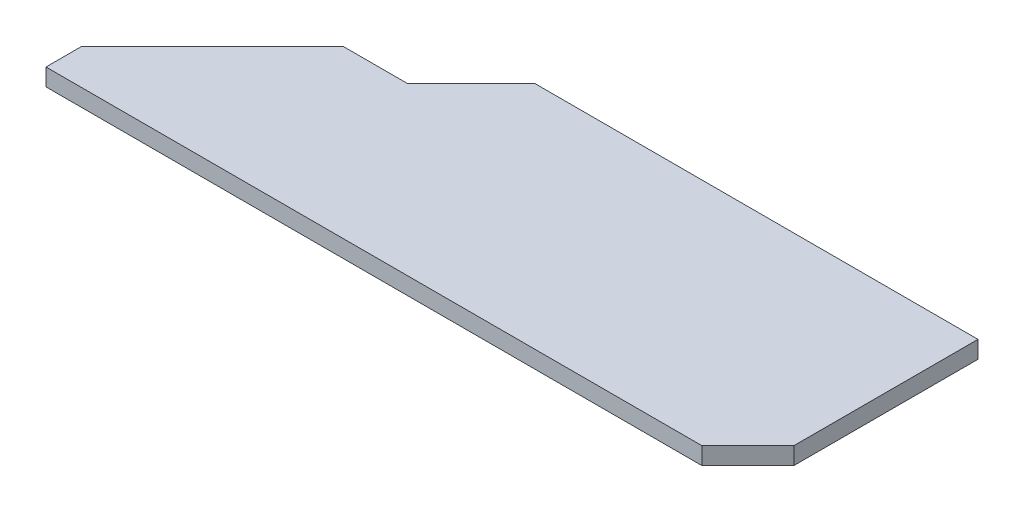
ISO-10303-21;
HEADER;
FILE_DESCRIPTION(('STEP AP214'),'2;1');
FILE_NAME('part.step','',(''),(''),'','','');
FILE_SCHEMA(('AUTOMOTIVE_DESIGN { 1 0 10303 214 1 1 1 1 }'));
ENDSEC;
DATA;
#1=APPLICATION_CONTEXT('core data for automotive mechanical design processes');
#2=APPLICATION_PROTOCOL_DEFINITION('international standard','automotive_design',2000,#1);
#3=PRODUCT_CONTEXT('',#1,'mechanical');
#4=PRODUCT('Part','Part','',(#3));
#5=PRODUCT_RELATED_PRODUCT_CATEGORY('part','',(#4));
#6=PRODUCT_DEFINITION_FORMATION('','',#4);
#7=PRODUCT_DEFINITION_CONTEXT('part definition',#1,'design');
#8=PRODUCT_DEFINITION('design','',#6,#7);
#9=PRODUCT_DEFINITION_SHAPE('','',#8);
#10=(LENGTH_UNIT() NAMED_UNIT(*) SI_UNIT(.MILLI.,.METRE.));
#11=(NAMED_UNIT(*) PLANE_ANGLE_UNIT() SI_UNIT($,.RADIAN.));
#12=(NAMED_UNIT(*) SI_UNIT($,.STERADIAN.) SOLID_ANGLE_UNIT());
#13=UNCERTAINTY_MEASURE_WITH_UNIT(LENGTH_MEASURE(1.E-05),#10,'distance_accuracy_value','');
#14=(GEOMETRIC_REPRESENTATION_CONTEXT(3) GLOBAL_UNCERTAINTY_ASSIGNED_CONTEXT((#13)) GLOBAL_UNIT_ASSIGNED_CONTEXT((#10,
#11,#12)) REPRESENTATION_CONTEXT('',''));
#15=CARTESIAN_POINT('',(0.,0.,0.));
#16=DIRECTION('',(0.,0.,1.));
#17=DIRECTION('',(1.,0.,0.));
#18=AXIS2_PLACEMENT_3D('',#15,#16,#17);
#19=CARTESIAN_POINT('',(-81.4855072463768,3.,-32.7355072463768));
#20=DIRECTION('',(1.,0.,0.));
#21=DIRECTION('',(0.,0.,-1.));
#22=AXIS2_PLACEMENT_3D('',#19,#20,#21);
#23=PLANE('',#22);
#24=DIRECTION('',(0.,0.,1.));
#25=VECTOR('',#24,1.);
#26=CARTESIAN_POINT('',(-81.4855072463768,3.,-32.7355072463768));
#27=LINE('',#26,#25);
#28=CARTESIAN_POINT('',(-81.4855072463769,3.,1.07792425569734));
#29=VERTEX_POINT('',#28);
#30=CARTESIAN_POINT('',(-81.4855072463769,3.,7.26449275362318));
#31=VERTEX_POINT('',#30);
#32=EDGE_CURVE('E159',#29,#31,#27,.T.);
#33=ORIENTED_EDGE('',*,*,#32,.F.);
#34=DIRECTION('',(0.,1.,0.));
#35=VECTOR('',#34,1.);
#36=CARTESIAN_POINT('',(-81.4855072463769,0.,1.07792425569734));
#37=LINE('',#36,#35);
#38=CARTESIAN_POINT('',(-81.4855072463769,0.,1.07792425569734));
#39=VERTEX_POINT('',#38);
#40=EDGE_CURVE('E146',#39,#29,#37,.T.);
#41=ORIENTED_EDGE('',*,*,#40,.F.);
#42=DIRECTION('',(0.,0.,1.));
#43=VECTOR('',#42,1.);
#44=CARTESIAN_POINT('',(-81.4855072463768,0.,-32.7355072463768));
#45=LINE('',#44,#43);
#46=CARTESIAN_POINT('',(-81.4855072463769,0.,7.26449275362318));
#47=VERTEX_POINT('',#46);
#48=EDGE_CURVE('E66',#39,#47,#45,.T.);
#49=ORIENTED_EDGE('',*,*,#48,.T.);
#50=DIRECTION('',(0.,-1.,0.));
#51=VECTOR('',#50,1.);
#52=CARTESIAN_POINT('',(-81.4855072463769,3.,7.26449275362318));
#53=LINE('',#52,#51);
#54=EDGE_CURVE('E11',#31,#47,#53,.T.);
#55=ORIENTED_EDGE('',*,*,#54,.F.);
#56=EDGE_LOOP('',(#33,#41,#49,#55));
#57=FACE_BOUND('',#56,.T.);
#58=ADVANCED_FACE('F32',(#57),#23,.F.);
#59=CARTESIAN_POINT('',(-81.4855072463769,3.,7.26449275362318));
#60=DIRECTION('',(0.,0.,-1.));
#61=DIRECTION('',(-1.,0.,0.));
#62=AXIS2_PLACEMENT_3D('',#59,#60,#61);
#63=PLANE('',#62);
#64=DIRECTION('',(1.,0.,0.));
#65=VECTOR('',#64,1.);
#66=CARTESIAN_POINT('',(-81.4855072463769,0.,7.26449275362318));
#67=LINE('',#66,#65);
#68=CARTESIAN_POINT('',(32.5144927536232,0.,7.26449275362318));
#69=VERTEX_POINT('',#68);
#70=EDGE_CURVE('E111',#47,#69,#67,.T.);
#71=ORIENTED_EDGE('',*,*,#70,.T.);
#72=DIRECTION('',(0.,-1.,0.));
#73=VECTOR('',#72,1.);
#74=CARTESIAN_POINT('',(32.5144927536232,3.,7.26449275362318));
#75=LINE('',#74,#73);
#76=CARTESIAN_POINT('',(32.5144927536232,3.,7.26449275362318));
#77=VERTEX_POINT('',#76);
#78=EDGE_CURVE('E39',#77,#69,#75,.T.);
#79=ORIENTED_EDGE('',*,*,#78,.F.);
#80=DIRECTION('',(1.,0.,0.));
#81=VECTOR('',#80,1.);
#82=CARTESIAN_POINT('',(-81.4855072463769,3.,7.26449275362318));
#83=LINE('',#82,#81);
#84=EDGE_CURVE('E55',#31,#77,#83,.T.);
#85=ORIENTED_EDGE('',*,*,#84,.F.);
#86=ORIENTED_EDGE('',*,*,#54,.T.);
#87=EDGE_LOOP('',(#71,#79,#85,#86));
#88=FACE_BOUND('',#87,.T.);
#89=ADVANCED_FACE('F113',(#88),#63,.F.);
#90=CARTESIAN_POINT('',(-81.4855072463768,3.,-32.7355072463768));
#91=DIRECTION('',(0.,0.,1.));
#92=DIRECTION('',(1.,0.,0.));
#93=AXIS2_PLACEMENT_3D('',#90,#91,#92);
#94=PLANE('',#93);
#95=DIRECTION('',(-1.,0.,0.));
#96=VECTOR('',#95,1.);
#97=CARTESIAN_POINT('',(-81.4855072463768,0.,-32.7355072463768));
#98=LINE('',#97,#96);
#99=CARTESIAN_POINT('',(40.5144927536232,0.,-32.7355072463768));
#100=VERTEX_POINT('',#99);
#101=CARTESIAN_POINT('',(-36.4855072463768,0.,-32.7355072463768));
#102=VERTEX_POINT('',#101);
#103=EDGE_CURVE('E117',#100,#102,#98,.T.);
#104=ORIENTED_EDGE('',*,*,#103,.T.);
#105=DIRECTION('',(0.,1.,0.));
#106=VECTOR('',#105,1.);
#107=CARTESIAN_POINT('',(-36.4855072463768,0.,-32.7355072463768));
#108=LINE('',#107,#106);
#109=CARTESIAN_POINT('',(-36.4855072463768,3.,-32.7355072463768));
#110=VERTEX_POINT('',#109);
#111=EDGE_CURVE('E75',#102,#110,#108,.T.);
#112=ORIENTED_EDGE('',*,*,#111,.T.);
#113=DIRECTION('',(-1.,0.,0.));
#114=VECTOR('',#113,1.);
#115=CARTESIAN_POINT('',(-81.4855072463768,3.,-32.7355072463768));
#116=LINE('',#115,#114);
#117=CARTESIAN_POINT('',(40.5144927536232,3.,-32.7355072463768));
#118=VERTEX_POINT('',#117);
#119=EDGE_CURVE('E124',#118,#110,#116,.T.);
#120=ORIENTED_EDGE('',*,*,#119,.F.);
#121=DIRECTION('',(0.,1.,0.));
#122=VECTOR('',#121,1.);
#123=CARTESIAN_POINT('',(40.5144927536232,0.,-32.7355072463768));
#124=LINE('',#123,#122);
#125=EDGE_CURVE('E137',#100,#118,#124,.T.);
#126=ORIENTED_EDGE('',*,*,#125,.F.);
#127=EDGE_LOOP('',(#104,#112,#120,#126));
#128=FACE_BOUND('',#127,.T.);
#129=ADVANCED_FACE('F168',(#128),#94,.F.);
#130=CARTESIAN_POINT('',(0.,3.,0.));
#131=DIRECTION('',(0.,1.,0.));
#132=DIRECTION('',(0.,0.,1.));
#133=AXIS2_PLACEMENT_3D('',#130,#131,#132);
#134=PLANE('',#133);
#135=DIRECTION('',(0.707106781186547,0.,-0.707106781186548));
#136=VECTOR('',#135,1.);
#137=CARTESIAN_POINT('',(-36.4855072463768,3.,-32.7355072463768));
#138=LINE('',#137,#136);
#139=CARTESIAN_POINT('',(-47.5608260580518,3.,-21.6601884347018));
#140=VERTEX_POINT('',#139);
#141=EDGE_CURVE('E91',#140,#110,#138,.T.);
#142=ORIENTED_EDGE('',*,*,#141,.F.);
#143=DIRECTION('',(1.,0.,0.));
#144=VECTOR('',#143,1.);
#145=CARTESIAN_POINT('',(-47.5608260580518,3.,-21.6601884347018));
#146=LINE('',#145,#144);
#147=CARTESIAN_POINT('',(-58.7473945559778,3.,-21.6601884347018));
#148=VERTEX_POINT('',#147);
#149=EDGE_CURVE('E149',#148,#140,#146,.T.);
#150=ORIENTED_EDGE('',*,*,#149,.F.);
#151=DIRECTION('',(0.707106781186548,0.,-0.707106781186547));
#152=VECTOR('',#151,1.);
#153=CARTESIAN_POINT('',(-72.5323385050532,3.,-7.87524448562647));
#154=LINE('',#153,#152);
#155=EDGE_CURVE('E140',#29,#148,#154,.T.);
#156=ORIENTED_EDGE('',*,*,#155,.F.);
#157=ORIENTED_EDGE('',*,*,#32,.T.);
#158=ORIENTED_EDGE('',*,*,#84,.T.);
#159=DIRECTION('',(0.707106781186546,0.,-0.707106781186549));
#160=VECTOR('',#159,1.);
#161=CARTESIAN_POINT('',(32.5144927536232,3.,7.26449275362318));
#162=LINE('',#161,#160);
#163=CARTESIAN_POINT('',(40.5144927536232,3.,-0.735507246376851));
#164=VERTEX_POINT('',#163);
#165=EDGE_CURVE('E123',#77,#164,#162,.T.);
#166=ORIENTED_EDGE('',*,*,#165,.T.);
#167=DIRECTION('',(0.,0.,-1.));
#168=VECTOR('',#167,1.);
#169=CARTESIAN_POINT('',(40.5144927536232,3.,-0.735507246376851));
#170=LINE('',#169,#168);
#171=EDGE_CURVE('E129',#164,#118,#170,.T.);
#172=ORIENTED_EDGE('',*,*,#171,.T.);
#173=ORIENTED_EDGE('',*,*,#119,.T.);
#174=EDGE_LOOP('',(#142,#150,#156,#157,#158,#166,#172,#173));
#175=FACE_BOUND('',#174,.T.);
#176=ADVANCED_FACE('F173',(#175),#134,.T.);
#177=CARTESIAN_POINT('',(0.,0.,0.));
#178=DIRECTION('',(0.,1.,0.));
#179=DIRECTION('',(0.,0.,1.));
#180=AXIS2_PLACEMENT_3D('',#177,#178,#179);
#181=PLANE('',#180);
#182=DIRECTION('',(1.,0.,0.));
#183=VECTOR('',#182,1.);
#184=CARTESIAN_POINT('',(-47.5608260580518,0.,-21.6601884347018));
#185=LINE('',#184,#183);
#186=CARTESIAN_POINT('',(-58.7473945559778,0.,-21.6601884347018));
#187=VERTEX_POINT('',#186);
#188=CARTESIAN_POINT('',(-47.5608260580518,0.,-21.6601884347018));
#189=VERTEX_POINT('',#188);
#190=EDGE_CURVE('E46',#187,#189,#185,.T.);
#191=ORIENTED_EDGE('',*,*,#190,.T.);
#192=DIRECTION('',(0.707106781186547,0.,-0.707106781186548));
#193=VECTOR('',#192,1.);
#194=CARTESIAN_POINT('',(-44.165937048698,0.,-25.0550774440556));
#195=LINE('',#194,#193);
#196=EDGE_CURVE('E144',#189,#102,#195,.T.);
#197=ORIENTED_EDGE('',*,*,#196,.T.);
#198=ORIENTED_EDGE('',*,*,#103,.F.);
#199=DIRECTION('',(0.,0.,-1.));
#200=VECTOR('',#199,1.);
#201=CARTESIAN_POINT('',(40.5144927536232,0.,-0.735507246376851));
#202=LINE('',#201,#200);
#203=CARTESIAN_POINT('',(40.5144927536232,0.,-0.735507246376851));
#204=VERTEX_POINT('',#203);
#205=EDGE_CURVE('E128',#204,#100,#202,.T.);
#206=ORIENTED_EDGE('',*,*,#205,.F.);
#207=DIRECTION('',(0.707106781186546,0.,-0.707106781186549));
#208=VECTOR('',#207,1.);
#209=CARTESIAN_POINT('',(32.5144927536232,0.,7.26449275362318));
#210=LINE('',#209,#208);
#211=EDGE_CURVE('E122',#69,#204,#210,.T.);
#212=ORIENTED_EDGE('',*,*,#211,.F.);
#213=ORIENTED_EDGE('',*,*,#70,.F.);
#214=ORIENTED_EDGE('',*,*,#48,.F.);
#215=DIRECTION('',(0.707106781186541,0.,-0.707106781186554));
#216=VECTOR('',#215,1.);
#217=CARTESIAN_POINT('',(-72.5323385050532,0.,-7.87524448562647));
#218=LINE('',#217,#216);
#219=EDGE_CURVE('E95',#39,#187,#218,.T.);
#220=ORIENTED_EDGE('',*,*,#219,.T.);
#221=EDGE_LOOP('',(#191,#197,#198,#206,#212,#213,#214,#220));
#222=FACE_BOUND('',#221,.T.);
#223=ADVANCED_FACE('F126',(#222),#181,.F.);
#224=CARTESIAN_POINT('',(-36.4855072463768,0.,-32.7355072463768));
#225=DIRECTION('',(0.707106781186548,0.,0.707106781186547));
#226=DIRECTION('',(0.707106781186547,0.,-0.707106781186548));
#227=AXIS2_PLACEMENT_3D('',#224,#225,#226);
#228=PLANE('',#227);
#229=ORIENTED_EDGE('',*,*,#141,.T.);
#230=ORIENTED_EDGE('',*,*,#111,.F.);
#231=ORIENTED_EDGE('',*,*,#196,.F.);
#232=DIRECTION('',(0.,1.,0.));
#233=VECTOR('',#232,1.);
#234=CARTESIAN_POINT('',(-47.5608260580518,0.,-21.6601884347018));
#235=LINE('',#234,#233);
#236=EDGE_CURVE('E154',#189,#140,#235,.T.);
#237=ORIENTED_EDGE('',*,*,#236,.T.);
#238=EDGE_LOOP('',(#229,#230,#231,#237));
#239=FACE_BOUND('',#238,.T.);
#240=ADVANCED_FACE('F169',(#239),#228,.F.);
#241=CARTESIAN_POINT('',(-47.5608260580518,0.,-21.6601884347018));
#242=DIRECTION('',(0.,0.,1.));
#243=DIRECTION('',(1.,0.,0.));
#244=AXIS2_PLACEMENT_3D('',#241,#242,#243);
#245=PLANE('',#244);
#246=ORIENTED_EDGE('',*,*,#149,.T.);
#247=ORIENTED_EDGE('',*,*,#236,.F.);
#248=ORIENTED_EDGE('',*,*,#190,.F.);
#249=DIRECTION('',(0.,1.,0.));
#250=VECTOR('',#249,1.);
#251=CARTESIAN_POINT('',(-58.7473945559778,0.,-21.6601884347018));
#252=LINE('',#251,#250);
#253=EDGE_CURVE('E156',#187,#148,#252,.T.);
#254=ORIENTED_EDGE('',*,*,#253,.T.);
#255=EDGE_LOOP('',(#246,#247,#248,#254));
#256=FACE_BOUND('',#255,.T.);
#257=ADVANCED_FACE('F171',(#256),#245,.F.);
#258=CARTESIAN_POINT('',(-72.5323385050532,0.,-7.87524448562647));
#259=DIRECTION('',(0.707106781186547,0.,0.707106781186548));
#260=DIRECTION('',(0.707106781186548,0.,-0.707106781186547));
#261=AXIS2_PLACEMENT_3D('',#258,#259,#260);
#262=PLANE('',#261);
#263=ORIENTED_EDGE('',*,*,#155,.T.);
#264=ORIENTED_EDGE('',*,*,#253,.F.);
#265=ORIENTED_EDGE('',*,*,#219,.F.);
#266=ORIENTED_EDGE('',*,*,#40,.T.);
#267=EDGE_LOOP('',(#263,#264,#265,#266));
#268=FACE_BOUND('',#267,.T.);
#269=ADVANCED_FACE('F178',(#268),#262,.F.);
#270=CARTESIAN_POINT('',(40.5144927536232,0.,-0.735507246376851));
#271=DIRECTION('',(1.,0.,0.));
#272=DIRECTION('',(0.,0.,-1.));
#273=AXIS2_PLACEMENT_3D('',#270,#271,#272);
#274=PLANE('',#273);
#275=ORIENTED_EDGE('',*,*,#171,.F.);
#276=DIRECTION('',(0.,1.,0.));
#277=VECTOR('',#276,1.);
#278=CARTESIAN_POINT('',(40.5144927536232,0.,-0.735507246376851));
#279=LINE('',#278,#277);
#280=EDGE_CURVE('E131',#204,#164,#279,.T.);
#281=ORIENTED_EDGE('',*,*,#280,.F.);
#282=ORIENTED_EDGE('',*,*,#205,.T.);
#283=ORIENTED_EDGE('',*,*,#125,.T.);
#284=EDGE_LOOP('',(#275,#281,#282,#283));
#285=FACE_BOUND('',#284,.T.);
#286=ADVANCED_FACE('F176',(#285),#274,.T.);
#287=CARTESIAN_POINT('',(32.5144927536232,0.,7.26449275362318));
#288=DIRECTION('',(0.707106781186549,0.,0.707106781186546));
#289=DIRECTION('',(0.707106781186546,0.,-0.707106781186549));
#290=AXIS2_PLACEMENT_3D('',#287,#288,#289);
#291=PLANE('',#290);
#292=ORIENTED_EDGE('',*,*,#165,.F.);
#293=ORIENTED_EDGE('',*,*,#78,.T.);
#294=ORIENTED_EDGE('',*,*,#211,.T.);
#295=ORIENTED_EDGE('',*,*,#280,.T.);
#296=EDGE_LOOP('',(#292,#293,#294,#295));
#297=FACE_BOUND('',#296,.T.);
#298=ADVANCED_FACE('F121',(#297),#291,.T.);
#299=CLOSED_SHELL('',(#58,#89,#129,#176,#223,#240,#257,#269,#286,#298));
#300=MANIFOLD_SOLID_BREP('B2',#299);
#301=ADVANCED_BREP_SHAPE_REPRESENTATION('',(#18,#300),#14);
#302=SHAPE_DEFINITION_REPRESENTATION(#9,#301);
ENDSEC;
END-ISO-10303-21;
